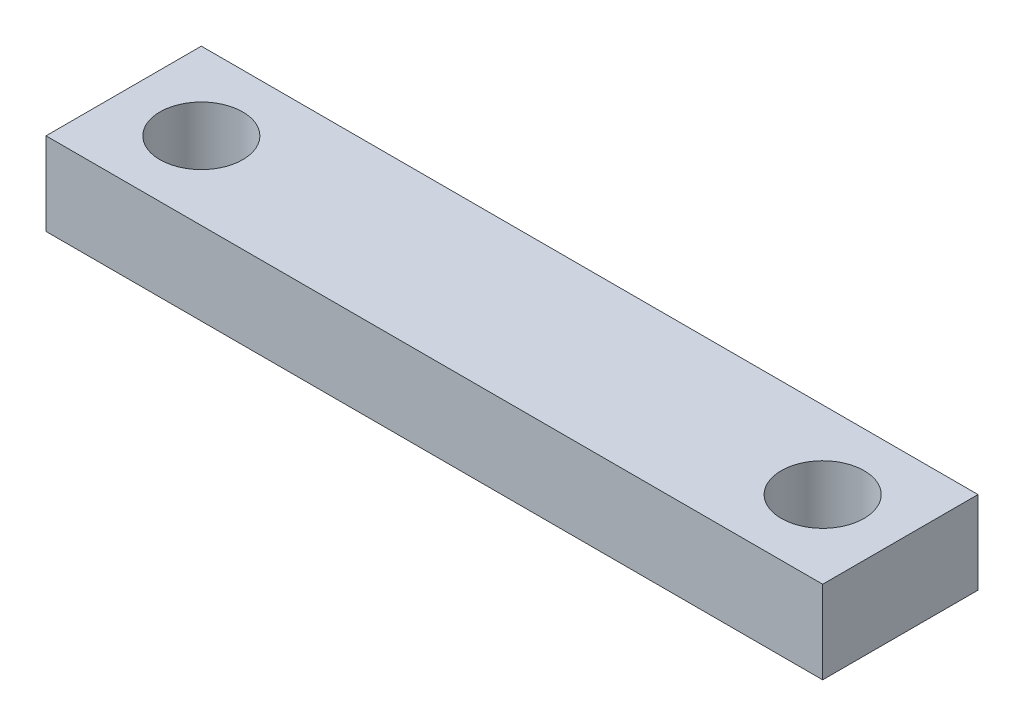
ISO-10303-21;
HEADER;
FILE_DESCRIPTION(('STEP AP214'),'2;1');
FILE_NAME('part.step','',(''),(''),'','','');
FILE_SCHEMA(('AUTOMOTIVE_DESIGN { 1 0 10303 214 1 1 1 1 }'));
ENDSEC;
DATA;
#1=APPLICATION_CONTEXT('core data for automotive mechanical design processes');
#2=APPLICATION_PROTOCOL_DEFINITION('international standard','automotive_design',2000,#1);
#3=PRODUCT_CONTEXT('',#1,'mechanical');
#4=PRODUCT('Part','Part','',(#3));
#5=PRODUCT_RELATED_PRODUCT_CATEGORY('part','',(#4));
#6=PRODUCT_DEFINITION_FORMATION('','',#4);
#7=PRODUCT_DEFINITION_CONTEXT('part definition',#1,'design');
#8=PRODUCT_DEFINITION('design','',#6,#7);
#9=PRODUCT_DEFINITION_SHAPE('','',#8);
#10=(LENGTH_UNIT() NAMED_UNIT(*) SI_UNIT(.MILLI.,.METRE.));
#11=(NAMED_UNIT(*) PLANE_ANGLE_UNIT() SI_UNIT($,.RADIAN.));
#12=(NAMED_UNIT(*) SI_UNIT($,.STERADIAN.) SOLID_ANGLE_UNIT());
#13=UNCERTAINTY_MEASURE_WITH_UNIT(LENGTH_MEASURE(1.E-05),#10,'distance_accuracy_value','');
#14=(GEOMETRIC_REPRESENTATION_CONTEXT(3) GLOBAL_UNCERTAINTY_ASSIGNED_CONTEXT((#13)) GLOBAL_UNIT_ASSIGNED_CONTEXT((#10,
#11,#12)) REPRESENTATION_CONTEXT('',''));
#15=CARTESIAN_POINT('',(0.,0.,0.));
#16=DIRECTION('',(0.,0.,1.));
#17=DIRECTION('',(1.,0.,0.));
#18=AXIS2_PLACEMENT_3D('',#15,#16,#17);
#19=CARTESIAN_POINT('',(0.,8.,7.50000000000001));
#20=DIRECTION('',(0.,0.,-1.));
#21=DIRECTION('',(-1.,0.,0.));
#22=AXIS2_PLACEMENT_3D('',#19,#20,#21);
#23=PLANE('',#22);
#24=DIRECTION('',(1.,0.,0.));
#25=VECTOR('',#24,1.);
#26=CARTESIAN_POINT('',(0.,0.,7.50000000000001));
#27=LINE('',#26,#25);
#28=CARTESIAN_POINT('',(-37.5,0.,7.50000000000001));
#29=VERTEX_POINT('',#28);
#30=CARTESIAN_POINT('',(37.5,0.,7.50000000000001));
#31=VERTEX_POINT('',#30);
#32=EDGE_CURVE('E119',#29,#31,#27,.T.);
#33=ORIENTED_EDGE('',*,*,#32,.T.);
#34=DIRECTION('',(0.,-1.,0.));
#35=VECTOR('',#34,1.);
#36=CARTESIAN_POINT('',(37.5,8.,7.50000000000001));
#37=LINE('',#36,#35);
#38=CARTESIAN_POINT('',(37.5,8.,7.50000000000001));
#39=VERTEX_POINT('',#38);
#40=EDGE_CURVE('E11',#39,#31,#37,.T.);
#41=ORIENTED_EDGE('',*,*,#40,.F.);
#42=DIRECTION('',(1.,0.,0.));
#43=VECTOR('',#42,1.);
#44=CARTESIAN_POINT('',(0.,8.,7.50000000000001));
#45=LINE('',#44,#43);
#46=CARTESIAN_POINT('',(-37.5,8.,7.50000000000001));
#47=VERTEX_POINT('',#46);
#48=EDGE_CURVE('E83',#47,#39,#45,.T.);
#49=ORIENTED_EDGE('',*,*,#48,.F.);
#50=DIRECTION('',(0.,-1.,0.));
#51=VECTOR('',#50,1.);
#52=CARTESIAN_POINT('',(-37.5,8.,7.50000000000001));
#53=LINE('',#52,#51);
#54=EDGE_CURVE('E118',#47,#29,#53,.T.);
#55=ORIENTED_EDGE('',*,*,#54,.T.);
#56=EDGE_LOOP('',(#33,#41,#49,#55));
#57=FACE_BOUND('',#56,.T.);
#58=ADVANCED_FACE('F43',(#57),#23,.F.);
#59=CARTESIAN_POINT('',(37.5,8.,0.));
#60=DIRECTION('',(1.,0.,0.));
#61=DIRECTION('',(0.,0.,-1.));
#62=AXIS2_PLACEMENT_3D('',#59,#60,#61);
#63=PLANE('',#62);
#64=DIRECTION('',(0.,0.,1.));
#65=VECTOR('',#64,1.);
#66=CARTESIAN_POINT('',(37.5,0.,0.));
#67=LINE('',#66,#65);
#68=CARTESIAN_POINT('',(37.5,0.,-7.49999999999999));
#69=VERTEX_POINT('',#68);
#70=EDGE_CURVE('E92',#69,#31,#67,.T.);
#71=ORIENTED_EDGE('',*,*,#70,.F.);
#72=DIRECTION('',(0.,-1.,0.));
#73=VECTOR('',#72,1.);
#74=CARTESIAN_POINT('',(37.5,8.,-7.49999999999999));
#75=LINE('',#74,#73);
#76=CARTESIAN_POINT('',(37.5,8.,-7.49999999999999));
#77=VERTEX_POINT('',#76);
#78=EDGE_CURVE('E52',#77,#69,#75,.T.);
#79=ORIENTED_EDGE('',*,*,#78,.F.);
#80=DIRECTION('',(0.,0.,1.));
#81=VECTOR('',#80,1.);
#82=CARTESIAN_POINT('',(37.5,8.,0.));
#83=LINE('',#82,#81);
#84=EDGE_CURVE('E90',#77,#39,#83,.T.);
#85=ORIENTED_EDGE('',*,*,#84,.T.);
#86=ORIENTED_EDGE('',*,*,#40,.T.);
#87=EDGE_LOOP('',(#71,#79,#85,#86));
#88=FACE_BOUND('',#87,.T.);
#89=ADVANCED_FACE('F89',(#88),#63,.T.);
#90=CARTESIAN_POINT('',(0.,8.,-7.5));
#91=DIRECTION('',(0.,0.,-1.));
#92=DIRECTION('',(-1.,0.,0.));
#93=AXIS2_PLACEMENT_3D('',#90,#91,#92);
#94=PLANE('',#93);
#95=DIRECTION('',(1.,0.,0.));
#96=VECTOR('',#95,1.);
#97=CARTESIAN_POINT('',(0.,0.,-7.5));
#98=LINE('',#97,#96);
#99=CARTESIAN_POINT('',(-37.5,0.,-7.50000000000001));
#100=VERTEX_POINT('',#99);
#101=EDGE_CURVE('E125',#100,#69,#98,.T.);
#102=ORIENTED_EDGE('',*,*,#101,.F.);
#103=DIRECTION('',(0.,-1.,0.));
#104=VECTOR('',#103,1.);
#105=CARTESIAN_POINT('',(-37.5,8.,-7.50000000000001));
#106=LINE('',#105,#104);
#107=CARTESIAN_POINT('',(-37.5,8.,-7.50000000000001));
#108=VERTEX_POINT('',#107);
#109=EDGE_CURVE('E75',#108,#100,#106,.T.);
#110=ORIENTED_EDGE('',*,*,#109,.F.);
#111=DIRECTION('',(1.,0.,0.));
#112=VECTOR('',#111,1.);
#113=CARTESIAN_POINT('',(0.,8.,-7.5));
#114=LINE('',#113,#112);
#115=EDGE_CURVE('E100',#108,#77,#114,.T.);
#116=ORIENTED_EDGE('',*,*,#115,.T.);
#117=ORIENTED_EDGE('',*,*,#78,.T.);
#118=EDGE_LOOP('',(#102,#110,#116,#117));
#119=FACE_BOUND('',#118,.T.);
#120=ADVANCED_FACE('F103',(#119),#94,.T.);
#121=CARTESIAN_POINT('',(-30.,8.,0.));
#122=DIRECTION('',(0.,-1.,0.));
#123=DIRECTION('',(0.,0.,-1.));
#124=AXIS2_PLACEMENT_3D('',#121,#122,#123);
#125=CYLINDRICAL_SURFACE('',#124,4.00000000000001);
#126=CARTESIAN_POINT('',(-30.,8.,0.));
#127=DIRECTION('',(0.,1.,0.));
#128=DIRECTION('',(0.,0.,1.));
#129=AXIS2_PLACEMENT_3D('',#126,#127,#128);
#130=CIRCLE('',#129,4.00000000000001);
#131=CARTESIAN_POINT('',(-30.,8.,4.00000000000001));
#132=VERTEX_POINT('',#131);
#133=EDGE_CURVE('E107',#132,#132,#130,.T.);
#134=ORIENTED_EDGE('',*,*,#133,.T.);
#135=EDGE_LOOP('',(#134));
#136=FACE_BOUND('',#135,.T.);
#137=CARTESIAN_POINT('',(-30.,0.,0.));
#138=DIRECTION('',(0.,1.,0.));
#139=DIRECTION('',(0.,0.,1.));
#140=AXIS2_PLACEMENT_3D('',#137,#138,#139);
#141=CIRCLE('',#140,4.00000000000001);
#142=CARTESIAN_POINT('',(-30.,0.,4.00000000000001));
#143=VERTEX_POINT('',#142);
#144=EDGE_CURVE('E130',#143,#143,#141,.T.);
#145=ORIENTED_EDGE('',*,*,#144,.F.);
#146=EDGE_LOOP('',(#145));
#147=FACE_BOUND('',#146,.T.);
#148=ADVANCED_FACE('F162',(#136,#147),#125,.F.);
#149=CARTESIAN_POINT('',(-37.5,8.,0.));
#150=DIRECTION('',(1.,0.,0.));
#151=DIRECTION('',(0.,0.,-1.));
#152=AXIS2_PLACEMENT_3D('',#149,#150,#151);
#153=PLANE('',#152);
#154=DIRECTION('',(0.,0.,1.));
#155=VECTOR('',#154,1.);
#156=CARTESIAN_POINT('',(-37.5,0.,0.));
#157=LINE('',#156,#155);
#158=EDGE_CURVE('E78',#100,#29,#157,.T.);
#159=ORIENTED_EDGE('',*,*,#158,.T.);
#160=ORIENTED_EDGE('',*,*,#54,.F.);
#161=DIRECTION('',(0.,0.,1.));
#162=VECTOR('',#161,1.);
#163=CARTESIAN_POINT('',(-37.5,8.,0.));
#164=LINE('',#163,#162);
#165=EDGE_CURVE('E60',#108,#47,#164,.T.);
#166=ORIENTED_EDGE('',*,*,#165,.F.);
#167=ORIENTED_EDGE('',*,*,#109,.T.);
#168=EDGE_LOOP('',(#159,#160,#166,#167));
#169=FACE_BOUND('',#168,.T.);
#170=ADVANCED_FACE('F154',(#169),#153,.F.);
#171=CARTESIAN_POINT('',(30.,8.,0.));
#172=DIRECTION('',(0.,-1.,0.));
#173=DIRECTION('',(0.,0.,-1.));
#174=AXIS2_PLACEMENT_3D('',#171,#172,#173);
#175=CYLINDRICAL_SURFACE('',#174,4.00000000000001);
#176=CARTESIAN_POINT('',(30.,8.,0.));
#177=DIRECTION('',(0.,1.,0.));
#178=DIRECTION('',(0.,0.,1.));
#179=AXIS2_PLACEMENT_3D('',#176,#177,#178);
#180=CIRCLE('',#179,4.00000000000001);
#181=CARTESIAN_POINT('',(30.,8.,4.00000000000001));
#182=VERTEX_POINT('',#181);
#183=EDGE_CURVE('E114',#182,#182,#180,.T.);
#184=ORIENTED_EDGE('',*,*,#183,.T.);
#185=EDGE_LOOP('',(#184));
#186=FACE_BOUND('',#185,.T.);
#187=CARTESIAN_POINT('',(30.,0.,0.));
#188=DIRECTION('',(0.,1.,0.));
#189=DIRECTION('',(0.,0.,1.));
#190=AXIS2_PLACEMENT_3D('',#187,#188,#189);
#191=CIRCLE('',#190,4.00000000000001);
#192=CARTESIAN_POINT('',(30.,0.,4.00000000000001));
#193=VERTEX_POINT('',#192);
#194=EDGE_CURVE('E134',#193,#193,#191,.T.);
#195=ORIENTED_EDGE('',*,*,#194,.F.);
#196=EDGE_LOOP('',(#195));
#197=FACE_BOUND('',#196,.T.);
#198=ADVANCED_FACE('F152',(#186,#197),#175,.F.);
#199=CARTESIAN_POINT('',(0.,8.,0.));
#200=DIRECTION('',(0.,1.,0.));
#201=DIRECTION('',(0.,0.,1.));
#202=AXIS2_PLACEMENT_3D('',#199,#200,#201);
#203=PLANE('',#202);
#204=ORIENTED_EDGE('',*,*,#48,.T.);
#205=ORIENTED_EDGE('',*,*,#84,.F.);
#206=ORIENTED_EDGE('',*,*,#115,.F.);
#207=ORIENTED_EDGE('',*,*,#165,.T.);
#208=EDGE_LOOP('',(#204,#205,#206,#207));
#209=FACE_BOUND('',#208,.T.);
#210=ORIENTED_EDGE('',*,*,#133,.F.);
#211=EDGE_LOOP('',(#210));
#212=FACE_BOUND('',#211,.T.);
#213=ORIENTED_EDGE('',*,*,#183,.F.);
#214=EDGE_LOOP('',(#213));
#215=FACE_BOUND('',#214,.T.);
#216=ADVANCED_FACE('F98',(#209,#212,#215),#203,.T.);
#217=CARTESIAN_POINT('',(0.,0.,0.));
#218=DIRECTION('',(0.,1.,0.));
#219=DIRECTION('',(0.,0.,1.));
#220=AXIS2_PLACEMENT_3D('',#217,#218,#219);
#221=PLANE('',#220);
#222=ORIENTED_EDGE('',*,*,#32,.F.);
#223=ORIENTED_EDGE('',*,*,#158,.F.);
#224=ORIENTED_EDGE('',*,*,#101,.T.);
#225=ORIENTED_EDGE('',*,*,#70,.T.);
#226=EDGE_LOOP('',(#222,#223,#224,#225));
#227=FACE_BOUND('',#226,.T.);
#228=ORIENTED_EDGE('',*,*,#144,.T.);
#229=EDGE_LOOP('',(#228));
#230=FACE_BOUND('',#229,.T.);
#231=ORIENTED_EDGE('',*,*,#194,.T.);
#232=EDGE_LOOP('',(#231));
#233=FACE_BOUND('',#232,.T.);
#234=ADVANCED_FACE('F144',(#227,#230,#233),#221,.F.);
#235=CLOSED_SHELL('',(#58,#89,#120,#148,#170,#198,#216,#234));
#236=MANIFOLD_SOLID_BREP('B2',#235);
#237=ADVANCED_BREP_SHAPE_REPRESENTATION('',(#18,#236),#14);
#238=SHAPE_DEFINITION_REPRESENTATION(#9,#237);
ENDSEC;
END-ISO-10303-21;
